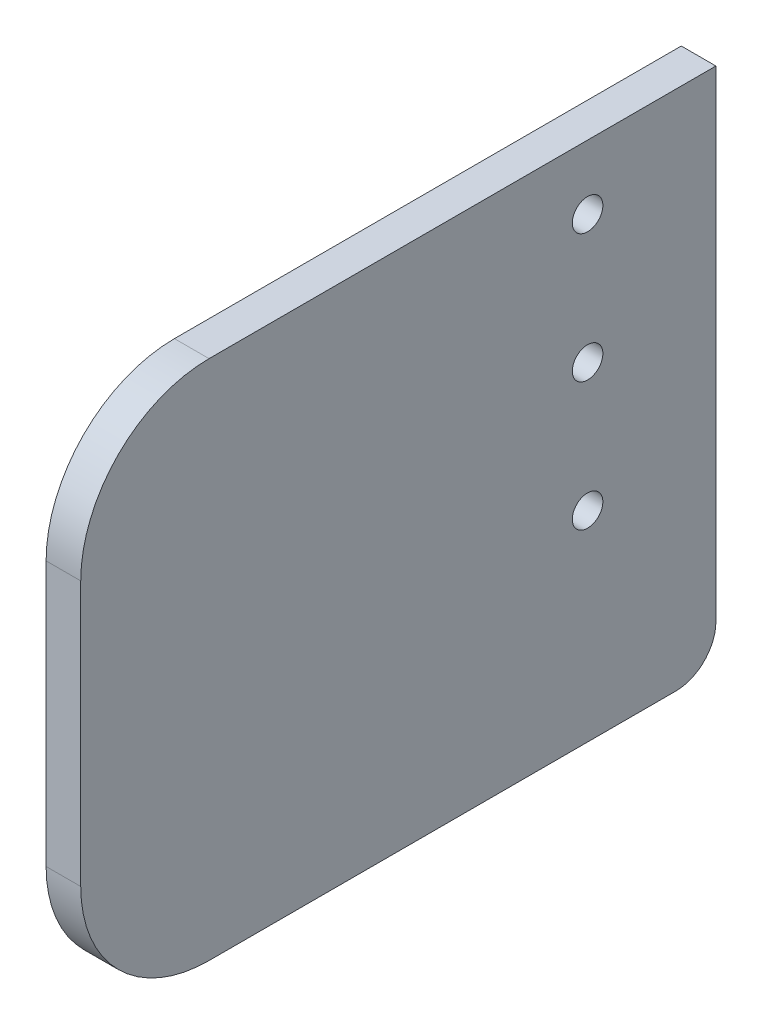
ISO-10303-21;
HEADER;
FILE_DESCRIPTION(('STEP AP214'),'2;1');
FILE_NAME('part.step','',(''),(''),'','','');
FILE_SCHEMA(('AUTOMOTIVE_DESIGN { 1 0 10303 214 1 1 1 1 }'));
ENDSEC;
DATA;
#1=APPLICATION_CONTEXT('core data for automotive mechanical design processes');
#2=APPLICATION_PROTOCOL_DEFINITION('international standard','automotive_design',2000,#1);
#3=PRODUCT_CONTEXT('',#1,'mechanical');
#4=PRODUCT('Part','Part','',(#3));
#5=PRODUCT_RELATED_PRODUCT_CATEGORY('part','',(#4));
#6=PRODUCT_DEFINITION_FORMATION('','',#4);
#7=PRODUCT_DEFINITION_CONTEXT('part definition',#1,'design');
#8=PRODUCT_DEFINITION('design','',#6,#7);
#9=PRODUCT_DEFINITION_SHAPE('','',#8);
#10=(LENGTH_UNIT() NAMED_UNIT(*) SI_UNIT(.MILLI.,.METRE.));
#11=(NAMED_UNIT(*) PLANE_ANGLE_UNIT() SI_UNIT($,.RADIAN.));
#12=(NAMED_UNIT(*) SI_UNIT($,.STERADIAN.) SOLID_ANGLE_UNIT());
#13=UNCERTAINTY_MEASURE_WITH_UNIT(LENGTH_MEASURE(1.E-05),#10,'distance_accuracy_value','');
#14=(GEOMETRIC_REPRESENTATION_CONTEXT(3) GLOBAL_UNCERTAINTY_ASSIGNED_CONTEXT((#13)) GLOBAL_UNIT_ASSIGNED_CONTEXT((#10,
#11,#12)) REPRESENTATION_CONTEXT('',''));
#15=CARTESIAN_POINT('',(0.,0.,0.));
#16=DIRECTION('',(0.,0.,1.));
#17=DIRECTION('',(1.,0.,0.));
#18=AXIS2_PLACEMENT_3D('',#15,#16,#17);
#19=CARTESIAN_POINT('',(-4.318,5.,-79.1959594928927));
#20=DIRECTION('',(0.,0.,-1.));
#21=DIRECTION('',(-1.,0.,0.));
#22=AXIS2_PLACEMENT_3D('',#19,#20,#21);
#23=PLANE('',#22);
#24=DIRECTION('',(0.,1.,0.));
#25=VECTOR('',#24,1.);
#26=CARTESIAN_POINT('',(0.,5.,-79.1959594928927));
#27=LINE('',#26,#25);
#28=CARTESIAN_POINT('',(0.,5.,-79.1959594928927));
#29=VERTEX_POINT('',#28);
#30=CARTESIAN_POINT('',(0.,65.,-79.1959594928927));
#31=VERTEX_POINT('',#30);
#32=EDGE_CURVE('E124',#29,#31,#27,.T.);
#33=ORIENTED_EDGE('',*,*,#32,.F.);
#34=DIRECTION('',(1.,0.,0.));
#35=VECTOR('',#34,1.);
#36=CARTESIAN_POINT('',(-4.318,5.,-79.1959594928927));
#37=LINE('',#36,#35);
#38=CARTESIAN_POINT('',(-4.318,5.,-79.1959594928927));
#39=VERTEX_POINT('',#38);
#40=EDGE_CURVE('E11',#39,#29,#37,.T.);
#41=ORIENTED_EDGE('',*,*,#40,.F.);
#42=DIRECTION('',(0.,1.,0.));
#43=VECTOR('',#42,1.);
#44=CARTESIAN_POINT('',(-4.318,5.,-79.1959594928927));
#45=LINE('',#44,#43);
#46=CARTESIAN_POINT('',(-4.318,65.,-79.1959594928927));
#47=VERTEX_POINT('',#46);
#48=EDGE_CURVE('E142',#39,#47,#45,.T.);
#49=ORIENTED_EDGE('',*,*,#48,.T.);
#50=DIRECTION('',(1.,0.,0.));
#51=VECTOR('',#50,1.);
#52=CARTESIAN_POINT('',(-4.318,65.,-79.1959594928927));
#53=LINE('',#52,#51);
#54=EDGE_CURVE('E36',#47,#31,#53,.T.);
#55=ORIENTED_EDGE('',*,*,#54,.T.);
#56=EDGE_LOOP('',(#33,#41,#49,#55));
#57=FACE_BOUND('',#56,.T.);
#58=ADVANCED_FACE('F33',(#57),#23,.T.);
#59=CARTESIAN_POINT('',(-4.318,5.,-74.1959594928927));
#60=DIRECTION('',(1.,0.,0.));
#61=DIRECTION('',(0.,0.,-1.));
#62=AXIS2_PLACEMENT_3D('',#59,#60,#61);
#63=CYLINDRICAL_SURFACE('',#62,5.);
#64=CARTESIAN_POINT('',(0.,5.,-74.1959594928927));
#65=DIRECTION('',(1.,0.,0.));
#66=DIRECTION('',(0.,0.,-1.));
#67=AXIS2_PLACEMENT_3D('',#64,#65,#66);
#68=CIRCLE('',#67,5.);
#69=CARTESIAN_POINT('',(0.,0.,-74.1959594928927));
#70=VERTEX_POINT('',#69);
#71=EDGE_CURVE('E140',#70,#29,#68,.T.);
#72=ORIENTED_EDGE('',*,*,#71,.F.);
#73=DIRECTION('',(1.,0.,0.));
#74=VECTOR('',#73,1.);
#75=CARTESIAN_POINT('',(-4.318,0.,-74.1959594928927));
#76=LINE('',#75,#74);
#77=CARTESIAN_POINT('',(-4.318,0.,-74.1959594928927));
#78=VERTEX_POINT('',#77);
#79=EDGE_CURVE('E42',#78,#70,#76,.T.);
#80=ORIENTED_EDGE('',*,*,#79,.F.);
#81=CARTESIAN_POINT('',(-4.318,5.,-74.1959594928927));
#82=DIRECTION('',(1.,0.,0.));
#83=DIRECTION('',(0.,0.,-1.));
#84=AXIS2_PLACEMENT_3D('',#81,#82,#83);
#85=CIRCLE('',#84,5.);
#86=EDGE_CURVE('E114',#78,#39,#85,.T.);
#87=ORIENTED_EDGE('',*,*,#86,.T.);
#88=ORIENTED_EDGE('',*,*,#40,.T.);
#89=EDGE_LOOP('',(#72,#80,#87,#88));
#90=FACE_BOUND('',#89,.T.);
#91=ADVANCED_FACE('F152',(#90),#63,.T.);
#92=CARTESIAN_POINT('',(-4.318,0.,-16.));
#93=DIRECTION('',(0.,-1.,0.));
#94=DIRECTION('',(0.,0.,-1.));
#95=AXIS2_PLACEMENT_3D('',#92,#93,#94);
#96=PLANE('',#95);
#97=DIRECTION('',(0.,0.,-1.));
#98=VECTOR('',#97,1.);
#99=CARTESIAN_POINT('',(0.,0.,-16.));
#100=LINE('',#99,#98);
#101=CARTESIAN_POINT('',(0.,0.,-16.));
#102=VERTEX_POINT('',#101);
#103=EDGE_CURVE('E101',#102,#70,#100,.T.);
#104=ORIENTED_EDGE('',*,*,#103,.F.);
#105=DIRECTION('',(1.,0.,0.));
#106=VECTOR('',#105,1.);
#107=CARTESIAN_POINT('',(-4.318,0.,-16.));
#108=LINE('',#107,#106);
#109=CARTESIAN_POINT('',(-4.318,0.,-16.));
#110=VERTEX_POINT('',#109);
#111=EDGE_CURVE('E96',#110,#102,#108,.T.);
#112=ORIENTED_EDGE('',*,*,#111,.F.);
#113=DIRECTION('',(0.,0.,-1.));
#114=VECTOR('',#113,1.);
#115=CARTESIAN_POINT('',(-4.318,0.,-16.));
#116=LINE('',#115,#114);
#117=EDGE_CURVE('E99',#110,#78,#116,.T.);
#118=ORIENTED_EDGE('',*,*,#117,.T.);
#119=ORIENTED_EDGE('',*,*,#79,.T.);
#120=EDGE_LOOP('',(#104,#112,#118,#119));
#121=FACE_BOUND('',#120,.T.);
#122=ADVANCED_FACE('F98',(#121),#96,.T.);
#123=CARTESIAN_POINT('',(-4.318,16.,-16.));
#124=DIRECTION('',(1.,0.,0.));
#125=DIRECTION('',(0.,0.,-1.));
#126=AXIS2_PLACEMENT_3D('',#123,#124,#125);
#127=CYLINDRICAL_SURFACE('',#126,16.);
#128=CARTESIAN_POINT('',(0.,16.,-16.));
#129=DIRECTION('',(1.,0.,0.));
#130=DIRECTION('',(0.,0.,1.));
#131=AXIS2_PLACEMENT_3D('',#128,#129,#130);
#132=CIRCLE('',#131,16.);
#133=CARTESIAN_POINT('',(0.,16.,0.));
#134=VERTEX_POINT('',#133);
#135=EDGE_CURVE('E137',#134,#102,#132,.T.);
#136=ORIENTED_EDGE('',*,*,#135,.F.);
#137=DIRECTION('',(1.,0.,0.));
#138=VECTOR('',#137,1.);
#139=CARTESIAN_POINT('',(-4.318,16.,0.));
#140=LINE('',#139,#138);
#141=CARTESIAN_POINT('',(-4.318,16.,0.));
#142=VERTEX_POINT('',#141);
#143=EDGE_CURVE('E106',#142,#134,#140,.T.);
#144=ORIENTED_EDGE('',*,*,#143,.F.);
#145=CARTESIAN_POINT('',(-4.318,16.,-16.));
#146=DIRECTION('',(1.,0.,0.));
#147=DIRECTION('',(0.,0.,1.));
#148=AXIS2_PLACEMENT_3D('',#145,#146,#147);
#149=CIRCLE('',#148,16.);
#150=EDGE_CURVE('E112',#142,#110,#149,.T.);
#151=ORIENTED_EDGE('',*,*,#150,.T.);
#152=ORIENTED_EDGE('',*,*,#111,.T.);
#153=EDGE_LOOP('',(#136,#144,#151,#152));
#154=FACE_BOUND('',#153,.T.);
#155=ADVANCED_FACE('F116',(#154),#127,.T.);
#156=CARTESIAN_POINT('',(-4.318,16.,0.));
#157=DIRECTION('',(0.,0.,1.));
#158=DIRECTION('',(1.,0.,0.));
#159=AXIS2_PLACEMENT_3D('',#156,#157,#158);
#160=PLANE('',#159);
#161=DIRECTION('',(0.,-1.,0.));
#162=VECTOR('',#161,1.);
#163=CARTESIAN_POINT('',(0.,16.,0.));
#164=LINE('',#163,#162);
#165=CARTESIAN_POINT('',(0.,49.,0.));
#166=VERTEX_POINT('',#165);
#167=EDGE_CURVE('E134',#166,#134,#164,.T.);
#168=ORIENTED_EDGE('',*,*,#167,.F.);
#169=DIRECTION('',(1.,0.,0.));
#170=VECTOR('',#169,1.);
#171=CARTESIAN_POINT('',(-4.318,49.,0.));
#172=LINE('',#171,#170);
#173=CARTESIAN_POINT('',(-4.318,49.,0.));
#174=VERTEX_POINT('',#173);
#175=EDGE_CURVE('E146',#174,#166,#172,.T.);
#176=ORIENTED_EDGE('',*,*,#175,.F.);
#177=DIRECTION('',(0.,-1.,0.));
#178=VECTOR('',#177,1.);
#179=CARTESIAN_POINT('',(-4.318,16.,0.));
#180=LINE('',#179,#178);
#181=EDGE_CURVE('E117',#174,#142,#180,.T.);
#182=ORIENTED_EDGE('',*,*,#181,.T.);
#183=ORIENTED_EDGE('',*,*,#143,.T.);
#184=EDGE_LOOP('',(#168,#176,#182,#183));
#185=FACE_BOUND('',#184,.T.);
#186=ADVANCED_FACE('F165',(#185),#160,.T.);
#187=CARTESIAN_POINT('',(-4.318,49.,-16.));
#188=DIRECTION('',(1.,0.,0.));
#189=DIRECTION('',(0.,0.,-1.));
#190=AXIS2_PLACEMENT_3D('',#187,#188,#189);
#191=CYLINDRICAL_SURFACE('',#190,16.);
#192=CARTESIAN_POINT('',(0.,49.,-16.));
#193=DIRECTION('',(1.,0.,0.));
#194=DIRECTION('',(0.,0.,1.));
#195=AXIS2_PLACEMENT_3D('',#192,#193,#194);
#196=CIRCLE('',#195,16.);
#197=CARTESIAN_POINT('',(0.,65.,-16.));
#198=VERTEX_POINT('',#197);
#199=EDGE_CURVE('E131',#198,#166,#196,.T.);
#200=ORIENTED_EDGE('',*,*,#199,.F.);
#201=DIRECTION('',(1.,0.,0.));
#202=VECTOR('',#201,1.);
#203=CARTESIAN_POINT('',(-4.318,65.,-16.));
#204=LINE('',#203,#202);
#205=CARTESIAN_POINT('',(-4.318,65.,-16.));
#206=VERTEX_POINT('',#205);
#207=EDGE_CURVE('E147',#206,#198,#204,.T.);
#208=ORIENTED_EDGE('',*,*,#207,.F.);
#209=CARTESIAN_POINT('',(-4.318,49.,-16.));
#210=DIRECTION('',(1.,0.,0.));
#211=DIRECTION('',(0.,0.,1.));
#212=AXIS2_PLACEMENT_3D('',#209,#210,#211);
#213=CIRCLE('',#212,16.);
#214=EDGE_CURVE('E119',#206,#174,#213,.T.);
#215=ORIENTED_EDGE('',*,*,#214,.T.);
#216=ORIENTED_EDGE('',*,*,#175,.T.);
#217=EDGE_LOOP('',(#200,#208,#215,#216));
#218=FACE_BOUND('',#217,.T.);
#219=ADVANCED_FACE('F168',(#218),#191,.T.);
#220=CARTESIAN_POINT('',(-4.318,65.,-16.));
#221=DIRECTION('',(0.,1.,0.));
#222=DIRECTION('',(0.,0.,1.));
#223=AXIS2_PLACEMENT_3D('',#220,#221,#222);
#224=PLANE('',#223);
#225=DIRECTION('',(0.,0.,1.));
#226=VECTOR('',#225,1.);
#227=CARTESIAN_POINT('',(0.,65.,-16.));
#228=LINE('',#227,#226);
#229=EDGE_CURVE('E127',#31,#198,#228,.T.);
#230=ORIENTED_EDGE('',*,*,#229,.F.);
#231=ORIENTED_EDGE('',*,*,#54,.F.);
#232=DIRECTION('',(0.,0.,1.));
#233=VECTOR('',#232,1.);
#234=CARTESIAN_POINT('',(-4.318,65.,-16.));
#235=LINE('',#234,#233);
#236=EDGE_CURVE('E218',#47,#206,#235,.T.);
#237=ORIENTED_EDGE('',*,*,#236,.T.);
#238=ORIENTED_EDGE('',*,*,#207,.T.);
#239=EDGE_LOOP('',(#230,#231,#237,#238));
#240=FACE_BOUND('',#239,.T.);
#241=ADVANCED_FACE('F149',(#240),#224,.T.);
#242=CARTESIAN_POINT('',(-4.318,49.,-16.));
#243=DIRECTION('',(-1.,0.,0.));
#244=DIRECTION('',(0.,0.,1.));
#245=AXIS2_PLACEMENT_3D('',#242,#243,#244);
#246=PLANE('',#245);
#247=CARTESIAN_POINT('',(-4.318,25.,-63.1959594928927));
#248=DIRECTION('',(1.,0.,0.));
#249=DIRECTION('',(0.,0.,-1.));
#250=AXIS2_PLACEMENT_3D('',#247,#248,#249);
#251=CIRCLE('',#250,1.90500000000001);
#252=CARTESIAN_POINT('',(-4.318,25.,-65.1009594928927));
#253=VERTEX_POINT('',#252);
#254=EDGE_CURVE('E199',#253,#253,#251,.T.);
#255=ORIENTED_EDGE('',*,*,#254,.T.);
#256=EDGE_LOOP('',(#255));
#257=FACE_BOUND('',#256,.T.);
#258=CARTESIAN_POINT('',(-4.318,41.,-63.1959594928927));
#259=DIRECTION('',(1.,0.,0.));
#260=DIRECTION('',(0.,0.,-1.));
#261=AXIS2_PLACEMENT_3D('',#258,#259,#260);
#262=CIRCLE('',#261,1.90500000000001);
#263=CARTESIAN_POINT('',(-4.318,41.,-65.1009594928927));
#264=VERTEX_POINT('',#263);
#265=EDGE_CURVE('E207',#264,#264,#262,.T.);
#266=ORIENTED_EDGE('',*,*,#265,.T.);
#267=EDGE_LOOP('',(#266));
#268=FACE_BOUND('',#267,.T.);
#269=CARTESIAN_POINT('',(-4.318,57.,-63.1959594928927));
#270=DIRECTION('',(1.,0.,0.));
#271=DIRECTION('',(0.,0.,-1.));
#272=AXIS2_PLACEMENT_3D('',#269,#270,#271);
#273=CIRCLE('',#272,1.90500000000001);
#274=CARTESIAN_POINT('',(-4.318,57.,-65.1009594928927));
#275=VERTEX_POINT('',#274);
#276=EDGE_CURVE('E128',#275,#275,#273,.T.);
#277=ORIENTED_EDGE('',*,*,#276,.T.);
#278=EDGE_LOOP('',(#277));
#279=FACE_BOUND('',#278,.T.);
#280=ORIENTED_EDGE('',*,*,#48,.F.);
#281=ORIENTED_EDGE('',*,*,#86,.F.);
#282=ORIENTED_EDGE('',*,*,#117,.F.);
#283=ORIENTED_EDGE('',*,*,#150,.F.);
#284=ORIENTED_EDGE('',*,*,#181,.F.);
#285=ORIENTED_EDGE('',*,*,#214,.F.);
#286=ORIENTED_EDGE('',*,*,#236,.F.);
#287=EDGE_LOOP('',(#280,#281,#282,#283,#284,#285,#286));
#288=FACE_BOUND('',#287,.T.);
#289=ADVANCED_FACE('F110',(#257,#268,#279,#288),#246,.T.);
#290=CARTESIAN_POINT('',(0.,49.,-16.));
#291=DIRECTION('',(-1.,0.,0.));
#292=DIRECTION('',(0.,0.,1.));
#293=AXIS2_PLACEMENT_3D('',#290,#291,#292);
#294=PLANE('',#293);
#295=CARTESIAN_POINT('',(0.,25.,-63.1959594928927));
#296=DIRECTION('',(1.,0.,0.));
#297=DIRECTION('',(0.,0.,-1.));
#298=AXIS2_PLACEMENT_3D('',#295,#296,#297);
#299=CIRCLE('',#298,1.90500000000001);
#300=CARTESIAN_POINT('',(0.,25.,-65.1009594928927));
#301=VERTEX_POINT('',#300);
#302=EDGE_CURVE('E202',#301,#301,#299,.T.);
#303=ORIENTED_EDGE('',*,*,#302,.F.);
#304=EDGE_LOOP('',(#303));
#305=FACE_BOUND('',#304,.T.);
#306=CARTESIAN_POINT('',(0.,41.,-63.1959594928927));
#307=DIRECTION('',(1.,0.,0.));
#308=DIRECTION('',(0.,0.,-1.));
#309=AXIS2_PLACEMENT_3D('',#306,#307,#308);
#310=CIRCLE('',#309,1.90500000000001);
#311=CARTESIAN_POINT('',(0.,41.,-65.1009594928927));
#312=VERTEX_POINT('',#311);
#313=EDGE_CURVE('E204',#312,#312,#310,.T.);
#314=ORIENTED_EDGE('',*,*,#313,.F.);
#315=EDGE_LOOP('',(#314));
#316=FACE_BOUND('',#315,.T.);
#317=CARTESIAN_POINT('',(0.,57.,-63.1959594928927));
#318=DIRECTION('',(1.,0.,0.));
#319=DIRECTION('',(0.,0.,-1.));
#320=AXIS2_PLACEMENT_3D('',#317,#318,#319);
#321=CIRCLE('',#320,1.90500000000001);
#322=CARTESIAN_POINT('',(0.,57.,-65.1009594928927));
#323=VERTEX_POINT('',#322);
#324=EDGE_CURVE('E210',#323,#323,#321,.T.);
#325=ORIENTED_EDGE('',*,*,#324,.F.);
#326=EDGE_LOOP('',(#325));
#327=FACE_BOUND('',#326,.T.);
#328=ORIENTED_EDGE('',*,*,#32,.T.);
#329=ORIENTED_EDGE('',*,*,#229,.T.);
#330=ORIENTED_EDGE('',*,*,#199,.T.);
#331=ORIENTED_EDGE('',*,*,#167,.T.);
#332=ORIENTED_EDGE('',*,*,#135,.T.);
#333=ORIENTED_EDGE('',*,*,#103,.T.);
#334=ORIENTED_EDGE('',*,*,#71,.T.);
#335=EDGE_LOOP('',(#328,#329,#330,#331,#332,#333,#334));
#336=FACE_BOUND('',#335,.T.);
#337=ADVANCED_FACE('F151',(#305,#316,#327,#336),#294,.F.);
#338=CARTESIAN_POINT('',(-4.318,57.,-63.1959594928927));
#339=DIRECTION('',(1.,0.,0.));
#340=DIRECTION('',(0.,0.,-1.));
#341=AXIS2_PLACEMENT_3D('',#338,#339,#340);
#342=CYLINDRICAL_SURFACE('',#341,1.90500000000001);
#343=ORIENTED_EDGE('',*,*,#276,.F.);
#344=EDGE_LOOP('',(#343));
#345=FACE_BOUND('',#344,.T.);
#346=ORIENTED_EDGE('',*,*,#324,.T.);
#347=EDGE_LOOP('',(#346));
#348=FACE_BOUND('',#347,.T.);
#349=ADVANCED_FACE('F180',(#345,#348),#342,.F.);
#350=CARTESIAN_POINT('',(-4.318,41.,-63.1959594928927));
#351=DIRECTION('',(1.,0.,0.));
#352=DIRECTION('',(0.,0.,-1.));
#353=AXIS2_PLACEMENT_3D('',#350,#351,#352);
#354=CYLINDRICAL_SURFACE('',#353,1.90500000000001);
#355=ORIENTED_EDGE('',*,*,#265,.F.);
#356=EDGE_LOOP('',(#355));
#357=FACE_BOUND('',#356,.T.);
#358=ORIENTED_EDGE('',*,*,#313,.T.);
#359=EDGE_LOOP('',(#358));
#360=FACE_BOUND('',#359,.T.);
#361=ADVANCED_FACE('F187',(#357,#360),#354,.F.);
#362=CARTESIAN_POINT('',(-4.318,25.,-63.1959594928927));
#363=DIRECTION('',(1.,0.,0.));
#364=DIRECTION('',(0.,0.,-1.));
#365=AXIS2_PLACEMENT_3D('',#362,#363,#364);
#366=CYLINDRICAL_SURFACE('',#365,1.90500000000001);
#367=ORIENTED_EDGE('',*,*,#254,.F.);
#368=EDGE_LOOP('',(#367));
#369=FACE_BOUND('',#368,.T.);
#370=ORIENTED_EDGE('',*,*,#302,.T.);
#371=EDGE_LOOP('',(#370));
#372=FACE_BOUND('',#371,.T.);
#373=ADVANCED_FACE('F191',(#369,#372),#366,.F.);
#374=CLOSED_SHELL('',(#58,#91,#122,#155,#186,#219,#241,#289,#337,#349,#361,#373));
#375=MANIFOLD_SOLID_BREP('B2',#374);
#376=ADVANCED_BREP_SHAPE_REPRESENTATION('',(#18,#375),#14);
#377=SHAPE_DEFINITION_REPRESENTATION(#9,#376);
ENDSEC;
END-ISO-10303-21;
